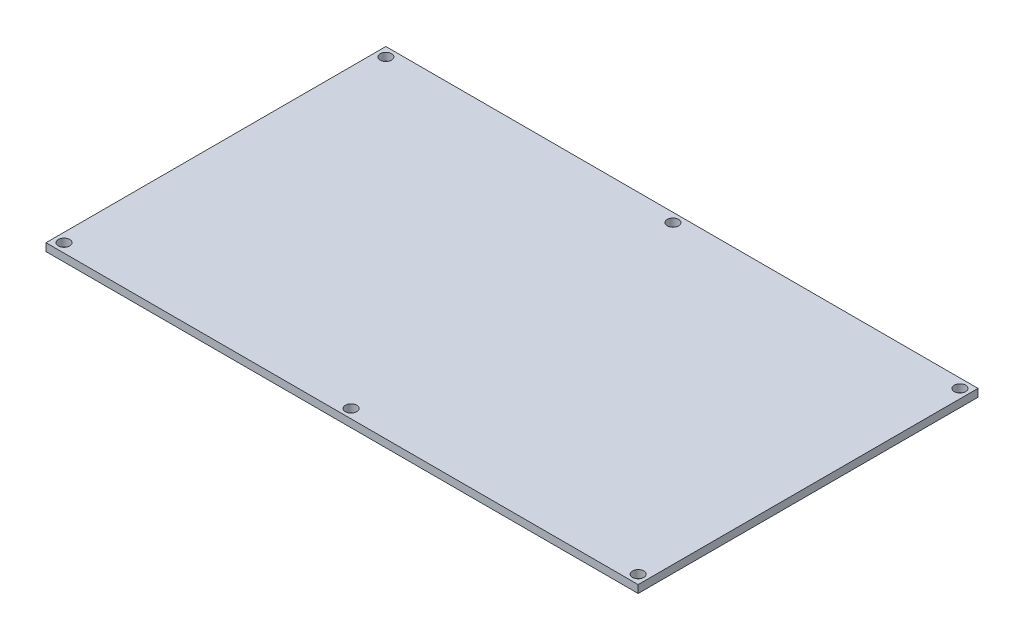
ISO-10303-21;
HEADER;
FILE_DESCRIPTION(('STEP AP214'),'2;1');
FILE_NAME('part.step','',(''),(''),'','','');
FILE_SCHEMA(('AUTOMOTIVE_DESIGN { 1 0 10303 214 1 1 1 1 }'));
ENDSEC;
DATA;
#1=APPLICATION_CONTEXT('core data for automotive mechanical design processes');
#2=APPLICATION_PROTOCOL_DEFINITION('international standard','automotive_design',2000,#1);
#3=PRODUCT_CONTEXT('',#1,'mechanical');
#4=PRODUCT('Part','Part','',(#3));
#5=PRODUCT_RELATED_PRODUCT_CATEGORY('part','',(#4));
#6=PRODUCT_DEFINITION_FORMATION('','',#4);
#7=PRODUCT_DEFINITION_CONTEXT('part definition',#1,'design');
#8=PRODUCT_DEFINITION('design','',#6,#7);
#9=PRODUCT_DEFINITION_SHAPE('','',#8);
#10=(LENGTH_UNIT() NAMED_UNIT(*) SI_UNIT(.MILLI.,.METRE.));
#11=(NAMED_UNIT(*) PLANE_ANGLE_UNIT() SI_UNIT($,.RADIAN.));
#12=(NAMED_UNIT(*) SI_UNIT($,.STERADIAN.) SOLID_ANGLE_UNIT());
#13=UNCERTAINTY_MEASURE_WITH_UNIT(LENGTH_MEASURE(1.E-05),#10,'distance_accuracy_value','');
#14=(GEOMETRIC_REPRESENTATION_CONTEXT(3) GLOBAL_UNCERTAINTY_ASSIGNED_CONTEXT((#13)) GLOBAL_UNIT_ASSIGNED_CONTEXT((#10,
#11,#12)) REPRESENTATION_CONTEXT('',''));
#15=CARTESIAN_POINT('',(0.,0.,0.));
#16=DIRECTION('',(0.,0.,1.));
#17=DIRECTION('',(1.,0.,0.));
#18=AXIS2_PLACEMENT_3D('',#15,#16,#17);
#19=CARTESIAN_POINT('',(-115.,3.,-66.));
#20=DIRECTION('',(1.,0.,0.));
#21=DIRECTION('',(0.,0.,-1.));
#22=AXIS2_PLACEMENT_3D('',#19,#20,#21);
#23=PLANE('',#22);
#24=DIRECTION('',(0.,0.,1.));
#25=VECTOR('',#24,1.);
#26=CARTESIAN_POINT('',(-115.,0.,-66.));
#27=LINE('',#26,#25);
#28=CARTESIAN_POINT('',(-115.,0.,-66.));
#29=VERTEX_POINT('',#28);
#30=CARTESIAN_POINT('',(-115.,0.,66.));
#31=VERTEX_POINT('',#30);
#32=EDGE_CURVE('E101',#29,#31,#27,.T.);
#33=ORIENTED_EDGE('',*,*,#32,.T.);
#34=DIRECTION('',(0.,-1.,0.));
#35=VECTOR('',#34,1.);
#36=CARTESIAN_POINT('',(-115.,3.,66.));
#37=LINE('',#36,#35);
#38=CARTESIAN_POINT('',(-115.,3.,66.));
#39=VERTEX_POINT('',#38);
#40=EDGE_CURVE('E11',#39,#31,#37,.T.);
#41=ORIENTED_EDGE('',*,*,#40,.F.);
#42=DIRECTION('',(0.,0.,1.));
#43=VECTOR('',#42,1.);
#44=CARTESIAN_POINT('',(-115.,3.,-66.));
#45=LINE('',#44,#43);
#46=CARTESIAN_POINT('',(-115.,3.,-66.));
#47=VERTEX_POINT('',#46);
#48=EDGE_CURVE('E88',#47,#39,#45,.T.);
#49=ORIENTED_EDGE('',*,*,#48,.F.);
#50=DIRECTION('',(0.,-1.,0.));
#51=VECTOR('',#50,1.);
#52=CARTESIAN_POINT('',(-115.,3.,-66.));
#53=LINE('',#52,#51);
#54=EDGE_CURVE('E97',#47,#29,#53,.T.);
#55=ORIENTED_EDGE('',*,*,#54,.T.);
#56=EDGE_LOOP('',(#33,#41,#49,#55));
#57=FACE_BOUND('',#56,.T.);
#58=ADVANCED_FACE('F35',(#57),#23,.F.);
#59=CARTESIAN_POINT('',(115.,3.,66.));
#60=DIRECTION('',(0.,0.,-1.));
#61=DIRECTION('',(-1.,0.,0.));
#62=AXIS2_PLACEMENT_3D('',#59,#60,#61);
#63=PLANE('',#62);
#64=DIRECTION('',(1.,0.,0.));
#65=VECTOR('',#64,1.);
#66=CARTESIAN_POINT('',(115.,0.,66.));
#67=LINE('',#66,#65);
#68=CARTESIAN_POINT('',(115.,0.,66.));
#69=VERTEX_POINT('',#68);
#70=EDGE_CURVE('E92',#31,#69,#67,.T.);
#71=ORIENTED_EDGE('',*,*,#70,.T.);
#72=DIRECTION('',(0.,-1.,0.));
#73=VECTOR('',#72,1.);
#74=CARTESIAN_POINT('',(115.,3.,66.));
#75=LINE('',#74,#73);
#76=CARTESIAN_POINT('',(115.,3.,66.));
#77=VERTEX_POINT('',#76);
#78=EDGE_CURVE('E44',#77,#69,#75,.T.);
#79=ORIENTED_EDGE('',*,*,#78,.F.);
#80=DIRECTION('',(1.,0.,0.));
#81=VECTOR('',#80,1.);
#82=CARTESIAN_POINT('',(115.,3.,66.));
#83=LINE('',#82,#81);
#84=EDGE_CURVE('E83',#39,#77,#83,.T.);
#85=ORIENTED_EDGE('',*,*,#84,.F.);
#86=ORIENTED_EDGE('',*,*,#40,.T.);
#87=EDGE_LOOP('',(#71,#79,#85,#86));
#88=FACE_BOUND('',#87,.T.);
#89=ADVANCED_FACE('F91',(#88),#63,.F.);
#90=CARTESIAN_POINT('',(115.,3.,-66.));
#91=DIRECTION('',(-1.,0.,0.));
#92=DIRECTION('',(0.,0.,1.));
#93=AXIS2_PLACEMENT_3D('',#90,#91,#92);
#94=PLANE('',#93);
#95=DIRECTION('',(0.,0.,-1.));
#96=VECTOR('',#95,1.);
#97=CARTESIAN_POINT('',(115.,0.,-66.));
#98=LINE('',#97,#96);
#99=CARTESIAN_POINT('',(115.,0.,-66.));
#100=VERTEX_POINT('',#99);
#101=EDGE_CURVE('E70',#69,#100,#98,.T.);
#102=ORIENTED_EDGE('',*,*,#101,.T.);
#103=DIRECTION('',(0.,-1.,0.));
#104=VECTOR('',#103,1.);
#105=CARTESIAN_POINT('',(115.,3.,-66.));
#106=LINE('',#105,#104);
#107=CARTESIAN_POINT('',(115.,3.,-66.));
#108=VERTEX_POINT('',#107);
#109=EDGE_CURVE('E93',#108,#100,#106,.T.);
#110=ORIENTED_EDGE('',*,*,#109,.F.);
#111=DIRECTION('',(0.,0.,-1.));
#112=VECTOR('',#111,1.);
#113=CARTESIAN_POINT('',(115.,3.,-66.));
#114=LINE('',#113,#112);
#115=EDGE_CURVE('E86',#77,#108,#114,.T.);
#116=ORIENTED_EDGE('',*,*,#115,.F.);
#117=ORIENTED_EDGE('',*,*,#78,.T.);
#118=EDGE_LOOP('',(#102,#110,#116,#117));
#119=FACE_BOUND('',#118,.T.);
#120=ADVANCED_FACE('F95',(#119),#94,.F.);
#121=CARTESIAN_POINT('',(115.,3.,-66.));
#122=DIRECTION('',(0.,0.,1.));
#123=DIRECTION('',(1.,0.,0.));
#124=AXIS2_PLACEMENT_3D('',#121,#122,#123);
#125=PLANE('',#124);
#126=DIRECTION('',(-1.,0.,0.));
#127=VECTOR('',#126,1.);
#128=CARTESIAN_POINT('',(115.,0.,-66.));
#129=LINE('',#128,#127);
#130=EDGE_CURVE('E76',#100,#29,#129,.T.);
#131=ORIENTED_EDGE('',*,*,#130,.T.);
#132=ORIENTED_EDGE('',*,*,#54,.F.);
#133=DIRECTION('',(-1.,0.,0.));
#134=VECTOR('',#133,1.);
#135=CARTESIAN_POINT('',(115.,3.,-66.));
#136=LINE('',#135,#134);
#137=EDGE_CURVE('E53',#108,#47,#136,.T.);
#138=ORIENTED_EDGE('',*,*,#137,.F.);
#139=ORIENTED_EDGE('',*,*,#109,.T.);
#140=EDGE_LOOP('',(#131,#132,#138,#139));
#141=FACE_BOUND('',#140,.T.);
#142=ADVANCED_FACE('F154',(#141),#125,.F.);
#143=CARTESIAN_POINT('',(0.,3.,0.));
#144=DIRECTION('',(0.,-1.,0.));
#145=DIRECTION('',(0.,0.,-1.));
#146=AXIS2_PLACEMENT_3D('',#143,#144,#145);
#147=PLANE('',#146);
#148=CARTESIAN_POINT('',(0.,3.,-62.5));
#149=DIRECTION('',(0.,1.,0.));
#150=DIRECTION('',(0.,0.,1.));
#151=AXIS2_PLACEMENT_3D('',#148,#149,#150);
#152=CIRCLE('',#151,2.2);
#153=CARTESIAN_POINT('',(0.,3.,-60.3));
#154=VERTEX_POINT('',#153);
#155=EDGE_CURVE('E117',#154,#154,#152,.T.);
#156=ORIENTED_EDGE('',*,*,#155,.F.);
#157=EDGE_LOOP('',(#156));
#158=FACE_BOUND('',#157,.T.);
#159=CARTESIAN_POINT('',(111.5,3.,-62.5));
#160=DIRECTION('',(0.,1.,0.));
#161=DIRECTION('',(0.,0.,1.));
#162=AXIS2_PLACEMENT_3D('',#159,#160,#161);
#163=CIRCLE('',#162,2.2);
#164=CARTESIAN_POINT('',(111.5,3.,-60.3));
#165=VERTEX_POINT('',#164);
#166=EDGE_CURVE('E143',#165,#165,#163,.T.);
#167=ORIENTED_EDGE('',*,*,#166,.F.);
#168=EDGE_LOOP('',(#167));
#169=FACE_BOUND('',#168,.T.);
#170=CARTESIAN_POINT('',(111.5,3.,62.5));
#171=DIRECTION('',(0.,1.,0.));
#172=DIRECTION('',(0.,0.,1.));
#173=AXIS2_PLACEMENT_3D('',#170,#171,#172);
#174=CIRCLE('',#173,2.2);
#175=CARTESIAN_POINT('',(111.5,3.,64.7));
#176=VERTEX_POINT('',#175);
#177=EDGE_CURVE('E140',#176,#176,#174,.T.);
#178=ORIENTED_EDGE('',*,*,#177,.F.);
#179=EDGE_LOOP('',(#178));
#180=FACE_BOUND('',#179,.T.);
#181=CARTESIAN_POINT('',(0.,3.,62.5));
#182=DIRECTION('',(0.,1.,0.));
#183=DIRECTION('',(0.,0.,1.));
#184=AXIS2_PLACEMENT_3D('',#181,#182,#183);
#185=CIRCLE('',#184,2.2);
#186=CARTESIAN_POINT('',(0.,3.,64.7));
#187=VERTEX_POINT('',#186);
#188=EDGE_CURVE('E137',#187,#187,#185,.T.);
#189=ORIENTED_EDGE('',*,*,#188,.F.);
#190=EDGE_LOOP('',(#189));
#191=FACE_BOUND('',#190,.T.);
#192=CARTESIAN_POINT('',(-111.5,3.,62.5));
#193=DIRECTION('',(0.,1.,0.));
#194=DIRECTION('',(0.,0.,1.));
#195=AXIS2_PLACEMENT_3D('',#192,#193,#194);
#196=CIRCLE('',#195,2.2);
#197=CARTESIAN_POINT('',(-111.5,3.,64.7));
#198=VERTEX_POINT('',#197);
#199=EDGE_CURVE('E134',#198,#198,#196,.T.);
#200=ORIENTED_EDGE('',*,*,#199,.F.);
#201=EDGE_LOOP('',(#200));
#202=FACE_BOUND('',#201,.T.);
#203=CARTESIAN_POINT('',(-111.5,3.,-62.5));
#204=DIRECTION('',(0.,1.,0.));
#205=DIRECTION('',(0.,0.,1.));
#206=AXIS2_PLACEMENT_3D('',#203,#204,#205);
#207=CIRCLE('',#206,2.2);
#208=CARTESIAN_POINT('',(-111.5,3.,-60.3));
#209=VERTEX_POINT('',#208);
#210=EDGE_CURVE('E112',#209,#209,#207,.T.);
#211=ORIENTED_EDGE('',*,*,#210,.F.);
#212=EDGE_LOOP('',(#211));
#213=FACE_BOUND('',#212,.T.);
#214=ORIENTED_EDGE('',*,*,#48,.T.);
#215=ORIENTED_EDGE('',*,*,#84,.T.);
#216=ORIENTED_EDGE('',*,*,#115,.T.);
#217=ORIENTED_EDGE('',*,*,#137,.T.);
#218=EDGE_LOOP('',(#214,#215,#216,#217));
#219=FACE_BOUND('',#218,.T.);
#220=ADVANCED_FACE('F84',(#158,#169,#180,#191,#202,#213,#219),#147,.F.);
#221=CARTESIAN_POINT('',(0.,0.,0.));
#222=DIRECTION('',(0.,-1.,0.));
#223=DIRECTION('',(0.,0.,-1.));
#224=AXIS2_PLACEMENT_3D('',#221,#222,#223);
#225=PLANE('',#224);
#226=CARTESIAN_POINT('',(0.,0.,-62.5));
#227=DIRECTION('',(0.,-1.,0.));
#228=DIRECTION('',(0.,0.,-1.));
#229=AXIS2_PLACEMENT_3D('',#226,#227,#228);
#230=CIRCLE('',#229,2.2);
#231=CARTESIAN_POINT('',(0.,0.,-64.7));
#232=VERTEX_POINT('',#231);
#233=EDGE_CURVE('E38',#232,#232,#230,.T.);
#234=ORIENTED_EDGE('',*,*,#233,.F.);
#235=EDGE_LOOP('',(#234));
#236=FACE_BOUND('',#235,.T.);
#237=CARTESIAN_POINT('',(111.5,0.,-62.5));
#238=DIRECTION('',(0.,-1.,0.));
#239=DIRECTION('',(0.,0.,-1.));
#240=AXIS2_PLACEMENT_3D('',#237,#238,#239);
#241=CIRCLE('',#240,2.2);
#242=CARTESIAN_POINT('',(111.5,0.,-64.7));
#243=VERTEX_POINT('',#242);
#244=EDGE_CURVE('E122',#243,#243,#241,.T.);
#245=ORIENTED_EDGE('',*,*,#244,.F.);
#246=EDGE_LOOP('',(#245));
#247=FACE_BOUND('',#246,.T.);
#248=CARTESIAN_POINT('',(111.5,0.,62.5));
#249=DIRECTION('',(0.,-1.,0.));
#250=DIRECTION('',(0.,0.,-1.));
#251=AXIS2_PLACEMENT_3D('',#248,#249,#250);
#252=CIRCLE('',#251,2.2);
#253=CARTESIAN_POINT('',(111.5,0.,60.3));
#254=VERTEX_POINT('',#253);
#255=EDGE_CURVE('E120',#254,#254,#252,.T.);
#256=ORIENTED_EDGE('',*,*,#255,.F.);
#257=EDGE_LOOP('',(#256));
#258=FACE_BOUND('',#257,.T.);
#259=CARTESIAN_POINT('',(0.,0.,62.5));
#260=DIRECTION('',(0.,-1.,0.));
#261=DIRECTION('',(0.,0.,-1.));
#262=AXIS2_PLACEMENT_3D('',#259,#260,#261);
#263=CIRCLE('',#262,2.2);
#264=CARTESIAN_POINT('',(0.,0.,60.3));
#265=VERTEX_POINT('',#264);
#266=EDGE_CURVE('E116',#265,#265,#263,.T.);
#267=ORIENTED_EDGE('',*,*,#266,.F.);
#268=EDGE_LOOP('',(#267));
#269=FACE_BOUND('',#268,.T.);
#270=CARTESIAN_POINT('',(-111.5,0.,62.5));
#271=DIRECTION('',(0.,-1.,0.));
#272=DIRECTION('',(0.,0.,-1.));
#273=AXIS2_PLACEMENT_3D('',#270,#271,#272);
#274=CIRCLE('',#273,2.2);
#275=CARTESIAN_POINT('',(-111.5,0.,60.3));
#276=VERTEX_POINT('',#275);
#277=EDGE_CURVE('E113',#276,#276,#274,.T.);
#278=ORIENTED_EDGE('',*,*,#277,.F.);
#279=EDGE_LOOP('',(#278));
#280=FACE_BOUND('',#279,.T.);
#281=CARTESIAN_POINT('',(-111.5,0.,-62.5));
#282=DIRECTION('',(0.,-1.,0.));
#283=DIRECTION('',(0.,0.,-1.));
#284=AXIS2_PLACEMENT_3D('',#281,#282,#283);
#285=CIRCLE('',#284,2.2);
#286=CARTESIAN_POINT('',(-111.5,0.,-64.7));
#287=VERTEX_POINT('',#286);
#288=EDGE_CURVE('E104',#287,#287,#285,.T.);
#289=ORIENTED_EDGE('',*,*,#288,.F.);
#290=EDGE_LOOP('',(#289));
#291=FACE_BOUND('',#290,.T.);
#292=ORIENTED_EDGE('',*,*,#32,.F.);
#293=ORIENTED_EDGE('',*,*,#130,.F.);
#294=ORIENTED_EDGE('',*,*,#101,.F.);
#295=ORIENTED_EDGE('',*,*,#70,.F.);
#296=EDGE_LOOP('',(#292,#293,#294,#295));
#297=FACE_BOUND('',#296,.T.);
#298=ADVANCED_FACE('F153',(#236,#247,#258,#269,#280,#291,#297),#225,.T.);
#299=CARTESIAN_POINT('',(-111.5,-1.,-62.5));
#300=DIRECTION('',(0.,1.,0.));
#301=DIRECTION('',(0.,0.,1.));
#302=AXIS2_PLACEMENT_3D('',#299,#300,#301);
#303=CYLINDRICAL_SURFACE('',#302,2.2);
#304=ORIENTED_EDGE('',*,*,#288,.T.);
#305=EDGE_LOOP('',(#304));
#306=FACE_BOUND('',#305,.T.);
#307=ORIENTED_EDGE('',*,*,#210,.T.);
#308=EDGE_LOOP('',(#307));
#309=FACE_BOUND('',#308,.T.);
#310=ADVANCED_FACE('F168',(#306,#309),#303,.F.);
#311=CARTESIAN_POINT('',(-111.5,-1.,62.5));
#312=DIRECTION('',(0.,1.,0.));
#313=DIRECTION('',(0.,0.,1.));
#314=AXIS2_PLACEMENT_3D('',#311,#312,#313);
#315=CYLINDRICAL_SURFACE('',#314,2.2);
#316=ORIENTED_EDGE('',*,*,#277,.T.);
#317=EDGE_LOOP('',(#316));
#318=FACE_BOUND('',#317,.T.);
#319=ORIENTED_EDGE('',*,*,#199,.T.);
#320=EDGE_LOOP('',(#319));
#321=FACE_BOUND('',#320,.T.);
#322=ADVANCED_FACE('F165',(#318,#321),#315,.F.);
#323=CARTESIAN_POINT('',(0.,-1.,62.5));
#324=DIRECTION('',(0.,1.,0.));
#325=DIRECTION('',(0.,0.,1.));
#326=AXIS2_PLACEMENT_3D('',#323,#324,#325);
#327=CYLINDRICAL_SURFACE('',#326,2.2);
#328=ORIENTED_EDGE('',*,*,#266,.T.);
#329=EDGE_LOOP('',(#328));
#330=FACE_BOUND('',#329,.T.);
#331=ORIENTED_EDGE('',*,*,#188,.T.);
#332=EDGE_LOOP('',(#331));
#333=FACE_BOUND('',#332,.T.);
#334=ADVANCED_FACE('F167',(#330,#333),#327,.F.);
#335=CARTESIAN_POINT('',(111.5,-1.,62.5));
#336=DIRECTION('',(0.,1.,0.));
#337=DIRECTION('',(0.,0.,1.));
#338=AXIS2_PLACEMENT_3D('',#335,#336,#337);
#339=CYLINDRICAL_SURFACE('',#338,2.2);
#340=ORIENTED_EDGE('',*,*,#255,.T.);
#341=EDGE_LOOP('',(#340));
#342=FACE_BOUND('',#341,.T.);
#343=ORIENTED_EDGE('',*,*,#177,.T.);
#344=EDGE_LOOP('',(#343));
#345=FACE_BOUND('',#344,.T.);
#346=ADVANCED_FACE('F175',(#342,#345),#339,.F.);
#347=CARTESIAN_POINT('',(111.5,-1.,-62.5));
#348=DIRECTION('',(0.,1.,0.));
#349=DIRECTION('',(0.,0.,1.));
#350=AXIS2_PLACEMENT_3D('',#347,#348,#349);
#351=CYLINDRICAL_SURFACE('',#350,2.2);
#352=ORIENTED_EDGE('',*,*,#244,.T.);
#353=EDGE_LOOP('',(#352));
#354=FACE_BOUND('',#353,.T.);
#355=ORIENTED_EDGE('',*,*,#166,.T.);
#356=EDGE_LOOP('',(#355));
#357=FACE_BOUND('',#356,.T.);
#358=ADVANCED_FACE('F238',(#354,#357),#351,.F.);
#359=CARTESIAN_POINT('',(0.,-1.,-62.5));
#360=DIRECTION('',(0.,1.,0.));
#361=DIRECTION('',(0.,0.,1.));
#362=AXIS2_PLACEMENT_3D('',#359,#360,#361);
#363=CYLINDRICAL_SURFACE('',#362,2.2);
#364=ORIENTED_EDGE('',*,*,#233,.T.);
#365=EDGE_LOOP('',(#364));
#366=FACE_BOUND('',#365,.T.);
#367=ORIENTED_EDGE('',*,*,#155,.T.);
#368=EDGE_LOOP('',(#367));
#369=FACE_BOUND('',#368,.T.);
#370=ADVANCED_FACE('F149',(#366,#369),#363,.F.);
#371=CLOSED_SHELL('',(#58,#89,#120,#142,#220,#298,#310,#322,#334,#346,#358,#370));
#372=MANIFOLD_SOLID_BREP('B2',#371);
#373=ADVANCED_BREP_SHAPE_REPRESENTATION('',(#18,#372),#14);
#374=SHAPE_DEFINITION_REPRESENTATION(#9,#373);
ENDSEC;
END-ISO-10303-21;
